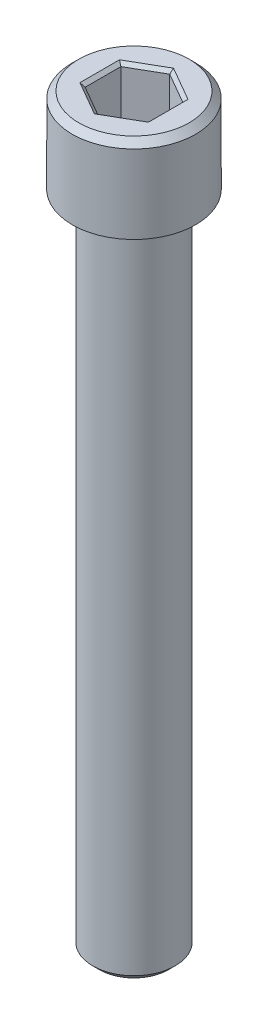
ISO-10303-21;
HEADER;
FILE_DESCRIPTION(('STEP AP214'),'2;1');
FILE_NAME('part.step','',(''),(''),'','','');
FILE_SCHEMA(('AUTOMOTIVE_DESIGN { 1 0 10303 214 1 1 1 1 }'));
ENDSEC;
DATA;
#1=APPLICATION_CONTEXT('core data for automotive mechanical design processes');
#2=APPLICATION_PROTOCOL_DEFINITION('international standard','automotive_design',2000,#1);
#3=PRODUCT_CONTEXT('',#1,'mechanical');
#4=PRODUCT('Part','Part','',(#3));
#5=PRODUCT_RELATED_PRODUCT_CATEGORY('part','',(#4));
#6=PRODUCT_DEFINITION_FORMATION('','',#4);
#7=PRODUCT_DEFINITION_CONTEXT('part definition',#1,'design');
#8=PRODUCT_DEFINITION('design','',#6,#7);
#9=PRODUCT_DEFINITION_SHAPE('','',#8);
#10=(LENGTH_UNIT() NAMED_UNIT(*) SI_UNIT(.MILLI.,.METRE.));
#11=(NAMED_UNIT(*) PLANE_ANGLE_UNIT() SI_UNIT($,.RADIAN.));
#12=(NAMED_UNIT(*) SI_UNIT($,.STERADIAN.) SOLID_ANGLE_UNIT());
#13=UNCERTAINTY_MEASURE_WITH_UNIT(LENGTH_MEASURE(1.E-05),#10,'distance_accuracy_value','');
#14=(GEOMETRIC_REPRESENTATION_CONTEXT(3) GLOBAL_UNCERTAINTY_ASSIGNED_CONTEXT((#13)) GLOBAL_UNIT_ASSIGNED_CONTEXT((#10,
#11,#12)) REPRESENTATION_CONTEXT('',''));
#15=CARTESIAN_POINT('',(0.,0.,0.));
#16=DIRECTION('',(0.,0.,1.));
#17=DIRECTION('',(1.,0.,0.));
#18=AXIS2_PLACEMENT_3D('',#15,#16,#17);
#19=CARTESIAN_POINT('',(-4.77519999999997,-4.57200000000002,0.));
#20=DIRECTION('',(0.,-1.,0.));
#21=DIRECTION('',(0.,0.,-1.));
#22=AXIS2_PLACEMENT_3D('',#19,#20,#21);
#23=PLANE('',#22);
#24=DIRECTION('',(-0.866025403784438,0.,0.5));
#25=VECTOR('',#24,1.);
#26=CARTESIAN_POINT('',(2.3876,-4.57200000000002,1.37848150271715));
#27=LINE('',#26,#25);
#28=CARTESIAN_POINT('',(2.3876,-4.57200000000002,1.37848150271715));
#29=VERTEX_POINT('',#28);
#30=CARTESIAN_POINT('',(0.,-4.57200000000002,2.7569630054343));
#31=VERTEX_POINT('',#30);
#32=EDGE_CURVE('E93',#29,#31,#27,.T.);
#33=ORIENTED_EDGE('',*,*,#32,.F.);
#34=DIRECTION('',(0.,0.,1.));
#35=VECTOR('',#34,1.);
#36=CARTESIAN_POINT('',(2.3876,-4.57200000000002,-1.37848150271715));
#37=LINE('',#36,#35);
#38=CARTESIAN_POINT('',(2.3876,-4.57200000000002,-1.37848150271715));
#39=VERTEX_POINT('',#38);
#40=EDGE_CURVE('E98',#39,#29,#37,.T.);
#41=ORIENTED_EDGE('',*,*,#40,.F.);
#42=DIRECTION('',(0.866025403784438,0.,0.5));
#43=VECTOR('',#42,1.);
#44=CARTESIAN_POINT('',(0.,-4.57200000000002,-2.75696300543429));
#45=LINE('',#44,#43);
#46=CARTESIAN_POINT('',(0.,-4.57200000000002,-2.75696300543429));
#47=VERTEX_POINT('',#46);
#48=EDGE_CURVE('E179',#47,#39,#45,.T.);
#49=ORIENTED_EDGE('',*,*,#48,.F.);
#50=DIRECTION('',(0.866025403784438,0.,-0.5));
#51=VECTOR('',#50,1.);
#52=CARTESIAN_POINT('',(-2.38759999999999,-4.57200000000002,-1.37848150271714));
#53=LINE('',#52,#51);
#54=CARTESIAN_POINT('',(-2.38759999999997,-4.57200000000002,-1.37848150271714));
#55=VERTEX_POINT('',#54);
#56=EDGE_CURVE('E185',#55,#47,#53,.T.);
#57=ORIENTED_EDGE('',*,*,#56,.F.);
#58=DIRECTION('',(0.,0.,-1.));
#59=VECTOR('',#58,1.);
#60=CARTESIAN_POINT('',(-2.38759999999996,-4.57200000000002,1.37848150271717));
#61=LINE('',#60,#59);
#62=CARTESIAN_POINT('',(-2.38759999999996,-4.57200000000002,1.37848150271717));
#63=VERTEX_POINT('',#62);
#64=EDGE_CURVE('E190',#63,#55,#61,.T.);
#65=ORIENTED_EDGE('',*,*,#64,.F.);
#66=DIRECTION('',(-0.866025403784438,0.,-0.500000000000001));
#67=VECTOR('',#66,1.);
#68=CARTESIAN_POINT('',(0.,-4.57200000000002,2.75696300543431));
#69=LINE('',#68,#67);
#70=EDGE_CURVE('E109',#31,#63,#69,.T.);
#71=ORIENTED_EDGE('',*,*,#70,.F.);
#72=EDGE_LOOP('',(#33,#41,#49,#57,#65,#71));
#73=FACE_BOUND('',#72,.T.);
#74=ADVANCED_FACE('F24',(#73),#23,.F.);
#75=CARTESIAN_POINT('',(2.3876,-4.57200000000002,-1.37848150271715));
#76=DIRECTION('',(-1.,0.,0.));
#77=DIRECTION('',(0.,0.,1.));
#78=AXIS2_PLACEMENT_3D('',#75,#76,#77);
#79=PLANE('',#78);
#80=DIRECTION('',(0.,1.,0.));
#81=VECTOR('',#80,1.);
#82=CARTESIAN_POINT('',(2.3876,-4.57200000000002,-1.37848150271715));
#83=LINE('',#82,#81);
#84=CARTESIAN_POINT('',(2.38760000000001,-0.253999999999981,-1.37848150271715));
#85=VERTEX_POINT('',#84);
#86=EDGE_CURVE('E103',#39,#85,#83,.T.);
#87=ORIENTED_EDGE('',*,*,#86,.F.);
#88=ORIENTED_EDGE('',*,*,#40,.T.);
#89=DIRECTION('',(0.,1.,0.));
#90=VECTOR('',#89,1.);
#91=CARTESIAN_POINT('',(2.3876,-4.57200000000002,1.37848150271715));
#92=LINE('',#91,#90);
#93=CARTESIAN_POINT('',(2.38760000000001,-0.25399999999998,1.37848150271715));
#94=VERTEX_POINT('',#93);
#95=EDGE_CURVE('E100',#94,#29,#92,.F.);
#96=ORIENTED_EDGE('',*,*,#95,.F.);
#97=DIRECTION('',(0.,0.,1.));
#98=VECTOR('',#97,1.);
#99=CARTESIAN_POINT('',(2.38760000000002,-0.25399999999999,0.));
#100=LINE('',#99,#98);
#101=EDGE_CURVE('E177',#94,#85,#100,.F.);
#102=ORIENTED_EDGE('',*,*,#101,.T.);
#103=EDGE_LOOP('',(#87,#88,#96,#102));
#104=FACE_BOUND('',#103,.T.);
#105=ADVANCED_FACE('F99',(#104),#79,.T.);
#106=CARTESIAN_POINT('',(2.3876,-4.57200000000002,1.37848150271715));
#107=DIRECTION('',(-0.5,0.,-0.866025403784438));
#108=DIRECTION('',(-0.866025403784438,0.,0.5));
#109=AXIS2_PLACEMENT_3D('',#106,#107,#108);
#110=PLANE('',#109);
#111=ORIENTED_EDGE('',*,*,#95,.T.);
#112=ORIENTED_EDGE('',*,*,#32,.T.);
#113=DIRECTION('',(0.,1.,0.));
#114=VECTOR('',#113,1.);
#115=CARTESIAN_POINT('',(0.,-4.57200000000002,2.75696300543431));
#116=LINE('',#115,#114);
#117=CARTESIAN_POINT('',(0.,-0.253999999999979,2.75696300543431));
#118=VERTEX_POINT('',#117);
#119=EDGE_CURVE('E111',#118,#31,#116,.F.);
#120=ORIENTED_EDGE('',*,*,#119,.F.);
#121=DIRECTION('',(0.866025403784438,0.,-0.500000000000001));
#122=VECTOR('',#121,1.);
#123=CARTESIAN_POINT('',(0.,-0.253999999999987,2.75696300543432));
#124=LINE('',#123,#122);
#125=EDGE_CURVE('E115',#118,#94,#124,.T.);
#126=ORIENTED_EDGE('',*,*,#125,.T.);
#127=EDGE_LOOP('',(#111,#112,#120,#126));
#128=FACE_BOUND('',#127,.T.);
#129=ADVANCED_FACE('F113',(#128),#110,.T.);
#130=CARTESIAN_POINT('',(0.,-4.57200000000002,2.75696300543431));
#131=DIRECTION('',(0.500000000000001,0.,-0.866025403784438));
#132=DIRECTION('',(-0.866025403784438,0.,-0.500000000000001));
#133=AXIS2_PLACEMENT_3D('',#130,#131,#132);
#134=PLANE('',#133);
#135=ORIENTED_EDGE('',*,*,#119,.T.);
#136=ORIENTED_EDGE('',*,*,#70,.T.);
#137=DIRECTION('',(0.,1.,0.));
#138=VECTOR('',#137,1.);
#139=CARTESIAN_POINT('',(-2.38759999999996,-4.57200000000002,1.37848150271717));
#140=LINE('',#139,#138);
#141=CARTESIAN_POINT('',(-2.38759999999997,-0.253999999999979,1.37848150271717));
#142=VERTEX_POINT('',#141);
#143=EDGE_CURVE('E192',#142,#63,#140,.F.);
#144=ORIENTED_EDGE('',*,*,#143,.F.);
#145=DIRECTION('',(0.866025403784438,0.,0.500000000000002));
#146=VECTOR('',#145,1.);
#147=CARTESIAN_POINT('',(-2.38759999999997,-0.253999999999992,1.37848150271718));
#148=LINE('',#147,#146);
#149=EDGE_CURVE('E171',#142,#118,#148,.T.);
#150=ORIENTED_EDGE('',*,*,#149,.T.);
#151=EDGE_LOOP('',(#135,#136,#144,#150));
#152=FACE_BOUND('',#151,.T.);
#153=ADVANCED_FACE('F196',(#152),#134,.T.);
#154=CARTESIAN_POINT('',(-2.38759999999996,-4.57200000000002,1.37848150271717));
#155=DIRECTION('',(1.,0.,0.));
#156=DIRECTION('',(0.,0.,-1.));
#157=AXIS2_PLACEMENT_3D('',#154,#155,#156);
#158=PLANE('',#157);
#159=ORIENTED_EDGE('',*,*,#143,.T.);
#160=ORIENTED_EDGE('',*,*,#64,.T.);
#161=DIRECTION('',(0.,1.,0.));
#162=VECTOR('',#161,1.);
#163=CARTESIAN_POINT('',(-2.38759999999999,-4.57200000000002,-1.37848150271714));
#164=LINE('',#163,#162);
#165=CARTESIAN_POINT('',(-2.38759999999998,-0.253999999999979,-1.37848150271714));
#166=VERTEX_POINT('',#165);
#167=EDGE_CURVE('E187',#166,#55,#164,.F.);
#168=ORIENTED_EDGE('',*,*,#167,.F.);
#169=DIRECTION('',(0.,0.,1.));
#170=VECTOR('',#169,1.);
#171=CARTESIAN_POINT('',(-2.3876,-0.253999999999983,0.));
#172=LINE('',#171,#170);
#173=EDGE_CURVE('E166',#166,#142,#172,.T.);
#174=ORIENTED_EDGE('',*,*,#173,.T.);
#175=EDGE_LOOP('',(#159,#160,#168,#174));
#176=FACE_BOUND('',#175,.T.);
#177=ADVANCED_FACE('F226',(#176),#158,.T.);
#178=CARTESIAN_POINT('',(-2.38759999999999,-4.57200000000002,-1.37848150271714));
#179=DIRECTION('',(0.5,0.,0.866025403784438));
#180=DIRECTION('',(0.866025403784438,0.,-0.5));
#181=AXIS2_PLACEMENT_3D('',#178,#179,#180);
#182=PLANE('',#181);
#183=ORIENTED_EDGE('',*,*,#167,.T.);
#184=ORIENTED_EDGE('',*,*,#56,.T.);
#185=DIRECTION('',(0.,1.,0.));
#186=VECTOR('',#185,1.);
#187=CARTESIAN_POINT('',(0.,-4.57200000000002,-2.75696300543429));
#188=LINE('',#187,#186);
#189=CARTESIAN_POINT('',(0.,-0.253999999999979,-2.7569630054343));
#190=VERTEX_POINT('',#189);
#191=EDGE_CURVE('E181',#190,#47,#188,.F.);
#192=ORIENTED_EDGE('',*,*,#191,.F.);
#193=DIRECTION('',(-0.866025403784438,0.,0.5));
#194=VECTOR('',#193,1.);
#195=CARTESIAN_POINT('',(0.,-0.253999999999991,-2.75696300543431));
#196=LINE('',#195,#194);
#197=EDGE_CURVE('E161',#190,#166,#196,.T.);
#198=ORIENTED_EDGE('',*,*,#197,.T.);
#199=EDGE_LOOP('',(#183,#184,#192,#198));
#200=FACE_BOUND('',#199,.T.);
#201=ADVANCED_FACE('F222',(#200),#182,.T.);
#202=CARTESIAN_POINT('',(0.,-4.57200000000002,-2.75696300543429));
#203=DIRECTION('',(-0.5,0.,0.866025403784438));
#204=DIRECTION('',(0.866025403784438,0.,0.5));
#205=AXIS2_PLACEMENT_3D('',#202,#203,#204);
#206=PLANE('',#205);
#207=ORIENTED_EDGE('',*,*,#191,.T.);
#208=ORIENTED_EDGE('',*,*,#48,.T.);
#209=ORIENTED_EDGE('',*,*,#86,.T.);
#210=DIRECTION('',(-0.866025403784438,0.,-0.5));
#211=VECTOR('',#210,1.);
#212=CARTESIAN_POINT('',(2.38760000000001,-0.253999999999982,-1.37848150271715));
#213=LINE('',#212,#211);
#214=EDGE_CURVE('E153',#85,#190,#213,.T.);
#215=ORIENTED_EDGE('',*,*,#214,.T.);
#216=EDGE_LOOP('',(#207,#208,#209,#215));
#217=FACE_BOUND('',#216,.T.);
#218=ADVANCED_FACE('F217',(#217),#206,.T.);
#219=CARTESIAN_POINT('',(2.64160000000001,0.,0.));
#220=DIRECTION('',(0.707106781186548,-0.707106781186547,0.));
#221=DIRECTION('',(0.707106781186547,0.707106781186548,0.));
#222=AXIS2_PLACEMENT_3D('',#219,#220,#221);
#223=PLANE('',#222);
#224=ORIENTED_EDGE('',*,*,#101,.F.);
#225=DIRECTION('',(0.654653670707951,0.654653670707987,0.377964473009256));
#226=VECTOR('',#225,1.);
#227=CARTESIAN_POINT('',(2.38760000000001,-0.253999999999991,1.37848150271716));
#228=LINE('',#227,#226);
#229=CARTESIAN_POINT('',(2.64160000000001,0.,1.52512847109134));
#230=VERTEX_POINT('',#229);
#231=EDGE_CURVE('E174',#94,#230,#228,.T.);
#232=ORIENTED_EDGE('',*,*,#231,.T.);
#233=DIRECTION('',(0.,0.,1.));
#234=VECTOR('',#233,1.);
#235=CARTESIAN_POINT('',(2.64160000000001,0.,0.));
#236=LINE('',#235,#234);
#237=CARTESIAN_POINT('',(2.64160000000001,0.,-1.52512847109129));
#238=VERTEX_POINT('',#237);
#239=EDGE_CURVE('E149',#238,#230,#236,.T.);
#240=ORIENTED_EDGE('',*,*,#239,.F.);
#241=DIRECTION('',(-0.654653670708017,-0.654653670707961,0.377964473009186));
#242=VECTOR('',#241,1.);
#243=CARTESIAN_POINT('',(2.64160000000001,0.,-1.52512847109129));
#244=LINE('',#243,#242);
#245=EDGE_CURVE('E156',#238,#85,#244,.T.);
#246=ORIENTED_EDGE('',*,*,#245,.T.);
#247=EDGE_LOOP('',(#224,#232,#240,#246));
#248=FACE_BOUND('',#247,.T.);
#249=ADVANCED_FACE('F212',(#248),#223,.F.);
#250=CARTESIAN_POINT('',(1.3208,0.,2.28769270663698));
#251=DIRECTION('',(0.353553390593274,-0.707106781186548,0.612372435695794));
#252=DIRECTION('',(0.,-0.654653670707976,-0.755928946018455));
#253=AXIS2_PLACEMENT_3D('',#250,#251,#252);
#254=PLANE('',#253);
#255=ORIENTED_EDGE('',*,*,#125,.F.);
#256=DIRECTION('',(0.,-0.654653670707977,-0.755928946018455));
#257=VECTOR('',#256,1.);
#258=CARTESIAN_POINT('',(0.,-0.377371428571426,2.61450595044226));
#259=LINE('',#258,#257);
#260=CARTESIAN_POINT('',(0.,0.,3.05025694218264));
#261=VERTEX_POINT('',#260);
#262=EDGE_CURVE('E169',#118,#261,#259,.F.);
#263=ORIENTED_EDGE('',*,*,#262,.T.);
#264=DIRECTION('',(-0.866025403784443,0.,0.499999999999993));
#265=VECTOR('',#264,1.);
#266=CARTESIAN_POINT('',(2.64160000000001,0.,1.52512847109135));
#267=LINE('',#266,#265);
#268=EDGE_CURVE('E146',#230,#261,#267,.T.);
#269=ORIENTED_EDGE('',*,*,#268,.F.);
#270=ORIENTED_EDGE('',*,*,#231,.F.);
#271=EDGE_LOOP('',(#255,#263,#269,#270));
#272=FACE_BOUND('',#271,.T.);
#273=ADVANCED_FACE('F203',(#272),#254,.F.);
#274=CARTESIAN_POINT('',(-1.3208,0.,2.28769270663698));
#275=DIRECTION('',(-0.353553390593274,-0.707106781186548,0.612372435695794));
#276=DIRECTION('',(0.,-0.654653670707977,-0.755928946018455));
#277=AXIS2_PLACEMENT_3D('',#274,#275,#276);
#278=PLANE('',#277);
#279=DIRECTION('',(-0.866025403784436,0.,-0.500000000000004));
#280=VECTOR('',#279,1.);
#281=CARTESIAN_POINT('',(0.,0.,3.05025694218264));
#282=LINE('',#281,#280);
#283=CARTESIAN_POINT('',(-2.64159999999998,0.,1.52512847109132));
#284=VERTEX_POINT('',#283);
#285=EDGE_CURVE('E143',#261,#284,#282,.T.);
#286=ORIENTED_EDGE('',*,*,#285,.F.);
#287=ORIENTED_EDGE('',*,*,#262,.F.);
#288=ORIENTED_EDGE('',*,*,#149,.F.);
#289=DIRECTION('',(-0.654653670707984,0.654653670707984,0.377964473009202));
#290=VECTOR('',#289,1.);
#291=CARTESIAN_POINT('',(-2.38759999999998,-0.253999999999997,1.37848150271717));
#292=LINE('',#291,#290);
#293=EDGE_CURVE('E164',#142,#284,#292,.T.);
#294=ORIENTED_EDGE('',*,*,#293,.T.);
#295=EDGE_LOOP('',(#286,#287,#288,#294));
#296=FACE_BOUND('',#295,.T.);
#297=ADVANCED_FACE('F206',(#296),#278,.F.);
#298=CARTESIAN_POINT('',(-2.64159999999998,0.,0.));
#299=DIRECTION('',(-0.707106781186548,-0.707106781186547,0.));
#300=DIRECTION('',(0.707106781186547,-0.707106781186548,0.));
#301=AXIS2_PLACEMENT_3D('',#298,#299,#300);
#302=PLANE('',#301);
#303=DIRECTION('',(0.,0.,1.));
#304=VECTOR('',#303,1.);
#305=CARTESIAN_POINT('',(-2.64159999999998,0.,0.));
#306=LINE('',#305,#304);
#307=CARTESIAN_POINT('',(-2.64159999999998,0.,-1.52512847109131));
#308=VERTEX_POINT('',#307);
#309=EDGE_CURVE('E140',#284,#308,#306,.F.);
#310=ORIENTED_EDGE('',*,*,#309,.F.);
#311=ORIENTED_EDGE('',*,*,#293,.F.);
#312=ORIENTED_EDGE('',*,*,#173,.F.);
#313=DIRECTION('',(-0.654653670707983,0.654653670707975,-0.377964473009221));
#314=VECTOR('',#313,1.);
#315=CARTESIAN_POINT('',(-2.3876,-0.253999999999991,-1.37848150271715));
#316=LINE('',#315,#314);
#317=EDGE_CURVE('E159',#166,#308,#316,.T.);
#318=ORIENTED_EDGE('',*,*,#317,.T.);
#319=EDGE_LOOP('',(#310,#311,#312,#318));
#320=FACE_BOUND('',#319,.T.);
#321=ADVANCED_FACE('F224',(#320),#302,.F.);
#322=CARTESIAN_POINT('',(-1.3208,0.,-2.28769270663697));
#323=DIRECTION('',(-0.353553390593274,-0.707106781186547,-0.612372435695795));
#324=DIRECTION('',(0.,0.654653670707977,-0.755928946018454));
#325=AXIS2_PLACEMENT_3D('',#322,#323,#324);
#326=PLANE('',#325);
#327=ORIENTED_EDGE('',*,*,#197,.F.);
#328=DIRECTION('',(0.,0.654653670707977,-0.755928946018455));
#329=VECTOR('',#328,1.);
#330=CARTESIAN_POINT('',(0.,-0.377371428571423,-2.61450595044224));
#331=LINE('',#330,#329);
#332=CARTESIAN_POINT('',(0.,0.,-3.05025694218262));
#333=VERTEX_POINT('',#332);
#334=EDGE_CURVE('E42',#190,#333,#331,.T.);
#335=ORIENTED_EDGE('',*,*,#334,.T.);
#336=DIRECTION('',(0.86602540378444,0.,-0.499999999999998));
#337=VECTOR('',#336,1.);
#338=CARTESIAN_POINT('',(-2.64159999999999,0.,-1.52512847109131));
#339=LINE('',#338,#337);
#340=EDGE_CURVE('E137',#308,#333,#339,.T.);
#341=ORIENTED_EDGE('',*,*,#340,.F.);
#342=ORIENTED_EDGE('',*,*,#317,.F.);
#343=EDGE_LOOP('',(#327,#335,#341,#342));
#344=FACE_BOUND('',#343,.T.);
#345=ADVANCED_FACE('F219',(#344),#326,.F.);
#346=CARTESIAN_POINT('',(1.3208,0.,-2.28769270663696));
#347=DIRECTION('',(0.353553390593274,-0.707106781186548,-0.612372435695794));
#348=DIRECTION('',(0.,0.654653670707977,-0.755928946018455));
#349=AXIS2_PLACEMENT_3D('',#346,#347,#348);
#350=PLANE('',#349);
#351=ORIENTED_EDGE('',*,*,#214,.F.);
#352=ORIENTED_EDGE('',*,*,#245,.F.);
#353=DIRECTION('',(0.866025403784436,0.,0.500000000000005));
#354=VECTOR('',#353,1.);
#355=CARTESIAN_POINT('',(0.,0.,-3.05025694218262));
#356=LINE('',#355,#354);
#357=EDGE_CURVE('E132',#333,#238,#356,.T.);
#358=ORIENTED_EDGE('',*,*,#357,.F.);
#359=ORIENTED_EDGE('',*,*,#334,.F.);
#360=EDGE_LOOP('',(#351,#352,#358,#359));
#361=FACE_BOUND('',#360,.T.);
#362=ADVANCED_FACE('F215',(#361),#350,.F.);
#363=CARTESIAN_POINT('',(0.,0.,0.));
#364=DIRECTION('',(0.,1.,0.));
#365=DIRECTION('',(0.,0.,1.));
#366=AXIS2_PLACEMENT_3D('',#363,#364,#365);
#367=PLANE('',#366);
#368=CARTESIAN_POINT('',(0.,0.,0.));
#369=DIRECTION('',(0.,-1.,0.));
#370=DIRECTION('',(0.,0.,-1.));
#371=AXIS2_PLACEMENT_3D('',#368,#369,#370);
#372=CIRCLE('',#371,4.25450000005867);
#373=CARTESIAN_POINT('',(0.,0.,-4.25450000005867));
#374=VERTEX_POINT('',#373);
#375=EDGE_CURVE('E27',#374,#374,#372,.T.);
#376=ORIENTED_EDGE('',*,*,#375,.F.);
#377=EDGE_LOOP('',(#376));
#378=FACE_BOUND('',#377,.T.);
#379=ORIENTED_EDGE('',*,*,#340,.T.);
#380=ORIENTED_EDGE('',*,*,#357,.T.);
#381=ORIENTED_EDGE('',*,*,#239,.T.);
#382=ORIENTED_EDGE('',*,*,#268,.T.);
#383=ORIENTED_EDGE('',*,*,#285,.T.);
#384=ORIENTED_EDGE('',*,*,#309,.T.);
#385=EDGE_LOOP('',(#379,#380,#381,#382,#383,#384));
#386=FACE_BOUND('',#385,.T.);
#387=ADVANCED_FACE('F209',(#378,#386),#367,.T.);
#388=CARTESIAN_POINT('',(0.,-0.507999999911135,0.));
#389=DIRECTION('',(0.,-1.,0.));
#390=DIRECTION('',(0.,0.,-1.));
#391=AXIS2_PLACEMENT_3D('',#388,#389,#390);
#392=CONICAL_SURFACE('',#391,4.76250000002665,0.785398163453397);
#393=CARTESIAN_POINT('',(0.,-0.507999999999953,0.));
#394=DIRECTION('',(0.,1.,0.));
#395=DIRECTION('',(0.,0.,1.));
#396=AXIS2_PLACEMENT_3D('',#393,#394,#395);
#397=CIRCLE('',#396,4.7625);
#398=CARTESIAN_POINT('',(0.,-0.507999999999953,4.7625));
#399=VERTEX_POINT('',#398);
#400=EDGE_CURVE('E124',#399,#399,#397,.F.);
#401=ORIENTED_EDGE('',*,*,#400,.F.);
#402=EDGE_LOOP('',(#401));
#403=FACE_BOUND('',#402,.T.);
#404=ORIENTED_EDGE('',*,*,#375,.T.);
#405=EDGE_LOOP('',(#404));
#406=FACE_BOUND('',#405,.T.);
#407=ADVANCED_FACE('F259',(#403,#406),#392,.T.);
#408=CARTESIAN_POINT('',(0.,-57.3531999999999,0.));
#409=DIRECTION('',(0.,1.,0.));
#410=DIRECTION('',(0.,0.,1.));
#411=AXIS2_PLACEMENT_3D('',#408,#409,#410);
#412=PLANE('',#411);
#413=CARTESIAN_POINT('',(0.,-57.3532000000228,0.));
#414=DIRECTION('',(0.,1.,0.));
#415=DIRECTION('',(-1.,0.,0.));
#416=AXIS2_PLACEMENT_3D('',#413,#414,#415);
#417=CIRCLE('',#416,2.66699999991715);
#418=CARTESIAN_POINT('',(-2.66699999991715,-57.3532000000228,0.));
#419=VERTEX_POINT('',#418);
#420=EDGE_CURVE('E122',#419,#419,#417,.T.);
#421=ORIENTED_EDGE('',*,*,#420,.F.);
#422=EDGE_LOOP('',(#421));
#423=FACE_BOUND('',#422,.T.);
#424=ADVANCED_FACE('F256',(#423),#412,.F.);
#425=CARTESIAN_POINT('',(0.,-6.55319999999992,0.));
#426=DIRECTION('',(0.,1.,0.));
#427=DIRECTION('',(0.,0.,1.));
#428=AXIS2_PLACEMENT_3D('',#425,#426,#427);
#429=CYLINDRICAL_SURFACE('',#428,4.7625);
#430=ORIENTED_EDGE('',*,*,#400,.T.);
#431=EDGE_LOOP('',(#430));
#432=FACE_BOUND('',#431,.T.);
#433=CARTESIAN_POINT('',(0.,-6.55319999999992,0.));
#434=DIRECTION('',(0.,1.,0.));
#435=DIRECTION('',(0.,0.,1.));
#436=AXIS2_PLACEMENT_3D('',#433,#434,#435);
#437=CIRCLE('',#436,4.7625);
#438=CARTESIAN_POINT('',(0.,-6.55319999999992,4.7625));
#439=VERTEX_POINT('',#438);
#440=EDGE_CURVE('E120',#439,#439,#437,.T.);
#441=ORIENTED_EDGE('',*,*,#440,.T.);
#442=EDGE_LOOP('',(#441));
#443=FACE_BOUND('',#442,.T.);
#444=ADVANCED_FACE('F252',(#432,#443),#429,.T.);
#445=CARTESIAN_POINT('',(0.,-56.8451999999411,0.));
#446=DIRECTION('',(0.,1.,0.));
#447=DIRECTION('',(-1.,0.,0.));
#448=AXIS2_PLACEMENT_3D('',#445,#446,#447);
#449=CONICAL_SURFACE('',#448,3.17499999999882,0.785398163397448);
#450=CARTESIAN_POINT('',(0.,-56.8451999999999,0.));
#451=DIRECTION('',(0.,1.,0.));
#452=DIRECTION('',(0.,0.,1.));
#453=AXIS2_PLACEMENT_3D('',#450,#451,#452);
#454=CIRCLE('',#453,3.175);
#455=CARTESIAN_POINT('',(0.,-56.8451999999999,3.175));
#456=VERTEX_POINT('',#455);
#457=EDGE_CURVE('E33',#456,#456,#454,.T.);
#458=ORIENTED_EDGE('',*,*,#457,.F.);
#459=EDGE_LOOP('',(#458));
#460=FACE_BOUND('',#459,.T.);
#461=ORIENTED_EDGE('',*,*,#420,.T.);
#462=EDGE_LOOP('',(#461));
#463=FACE_BOUND('',#462,.T.);
#464=ADVANCED_FACE('F245',(#460,#463),#449,.T.);
#465=CARTESIAN_POINT('',(0.,-6.55319999999992,0.));
#466=DIRECTION('',(0.,1.,0.));
#467=DIRECTION('',(0.,0.,1.));
#468=AXIS2_PLACEMENT_3D('',#465,#466,#467);
#469=PLANE('',#468);
#470=ORIENTED_EDGE('',*,*,#440,.F.);
#471=EDGE_LOOP('',(#470));
#472=FACE_BOUND('',#471,.T.);
#473=CARTESIAN_POINT('',(0.,-6.55319999999993,0.));
#474=DIRECTION('',(0.,1.,0.));
#475=DIRECTION('',(0.,0.,1.));
#476=AXIS2_PLACEMENT_3D('',#473,#474,#475);
#477=CIRCLE('',#476,3.175);
#478=CARTESIAN_POINT('',(0.,-6.55319999999993,3.175));
#479=VERTEX_POINT('',#478);
#480=EDGE_CURVE('E13',#479,#479,#477,.F.);
#481=ORIENTED_EDGE('',*,*,#480,.F.);
#482=EDGE_LOOP('',(#481));
#483=FACE_BOUND('',#482,.T.);
#484=ADVANCED_FACE('F239',(#472,#483),#469,.F.);
#485=CARTESIAN_POINT('',(0.,-57.3531999999999,0.));
#486=DIRECTION('',(0.,1.,0.));
#487=DIRECTION('',(0.,0.,1.));
#488=AXIS2_PLACEMENT_3D('',#485,#486,#487);
#489=CYLINDRICAL_SURFACE('',#488,3.175);
#490=ORIENTED_EDGE('',*,*,#480,.T.);
#491=EDGE_LOOP('',(#490));
#492=FACE_BOUND('',#491,.T.);
#493=ORIENTED_EDGE('',*,*,#457,.T.);
#494=EDGE_LOOP('',(#493));
#495=FACE_BOUND('',#494,.T.);
#496=ADVANCED_FACE('F237',(#492,#495),#489,.T.);
#497=CLOSED_SHELL('',(#74,#105,#129,#153,#177,#201,#218,#249,#273,#297,#321,#345,#362,#387,#407,
#424,#444,#464,#484,#496));
#498=MANIFOLD_SOLID_BREP('B1',#497);
#499=ADVANCED_BREP_SHAPE_REPRESENTATION('',(#18,#498),#14);
#500=SHAPE_DEFINITION_REPRESENTATION(#9,#499);
ENDSEC;
END-ISO-10303-21;
